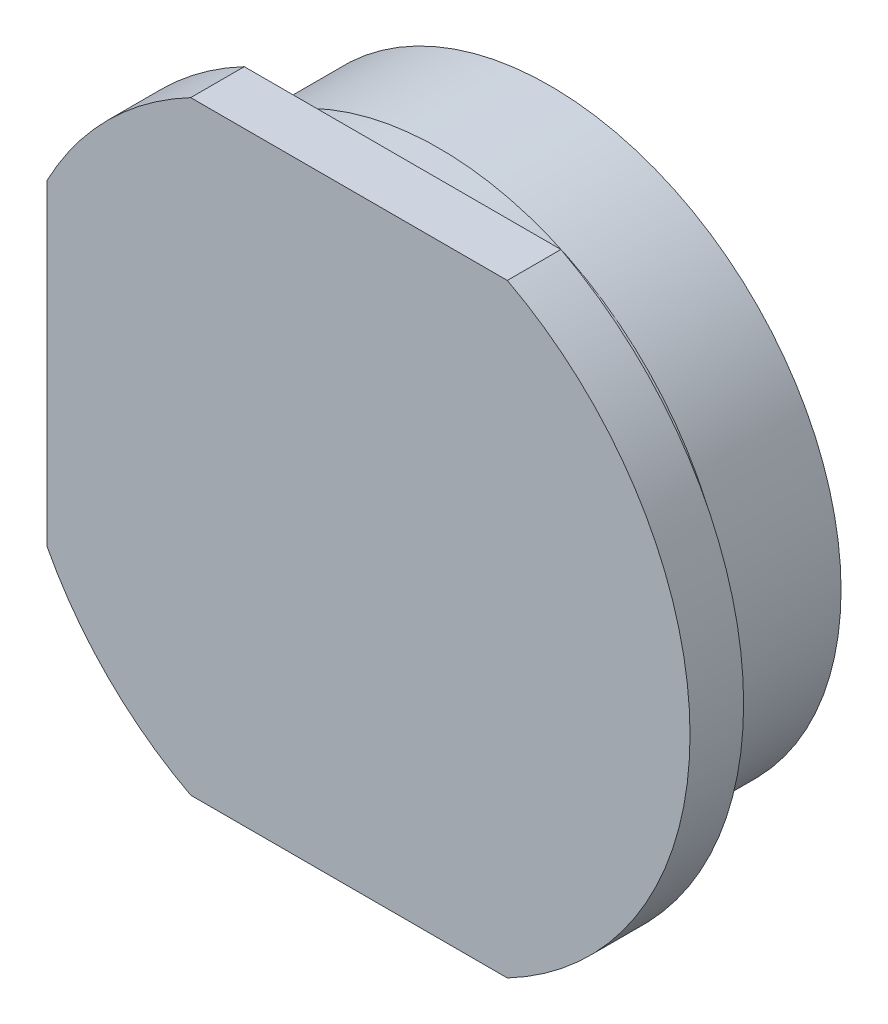
ISO-10303-21;
HEADER;
FILE_DESCRIPTION(('STEP AP214'),'2;1');
FILE_NAME('part.step','',(''),(''),'','','');
FILE_SCHEMA(('AUTOMOTIVE_DESIGN { 1 0 10303 214 1 1 1 1 }'));
ENDSEC;
DATA;
#1=APPLICATION_CONTEXT('core data for automotive mechanical design processes');
#2=APPLICATION_PROTOCOL_DEFINITION('international standard','automotive_design',2000,#1);
#3=PRODUCT_CONTEXT('',#1,'mechanical');
#4=PRODUCT('Part','Part','',(#3));
#5=PRODUCT_RELATED_PRODUCT_CATEGORY('part','',(#4));
#6=PRODUCT_DEFINITION_FORMATION('','',#4);
#7=PRODUCT_DEFINITION_CONTEXT('part definition',#1,'design');
#8=PRODUCT_DEFINITION('design','',#6,#7);
#9=PRODUCT_DEFINITION_SHAPE('','',#8);
#10=(LENGTH_UNIT() NAMED_UNIT(*) SI_UNIT(.MILLI.,.METRE.));
#11=(NAMED_UNIT(*) PLANE_ANGLE_UNIT() SI_UNIT($,.RADIAN.));
#12=(NAMED_UNIT(*) SI_UNIT($,.STERADIAN.) SOLID_ANGLE_UNIT());
#13=UNCERTAINTY_MEASURE_WITH_UNIT(LENGTH_MEASURE(1.E-05),#10,'distance_accuracy_value','');
#14=(GEOMETRIC_REPRESENTATION_CONTEXT(3) GLOBAL_UNCERTAINTY_ASSIGNED_CONTEXT((#13)) GLOBAL_UNIT_ASSIGNED_CONTEXT((#10,
#11,#12)) REPRESENTATION_CONTEXT('',''));
#15=CARTESIAN_POINT('',(0.,0.,0.));
#16=DIRECTION('',(0.,0.,1.));
#17=DIRECTION('',(1.,0.,0.));
#18=AXIS2_PLACEMENT_3D('',#15,#16,#17);
#19=CARTESIAN_POINT('',(-120.56,0.,90.5));
#20=DIRECTION('',(0.,0.,-1.));
#21=DIRECTION('',(-1.,0.,0.));
#22=AXIS2_PLACEMENT_3D('',#19,#20,#21);
#23=PLANE('',#22);
#24=DIRECTION('',(0.,-1.,0.));
#25=VECTOR('',#24,1.);
#26=CARTESIAN_POINT('',(-124.,124.,90.5));
#27=LINE('',#26,#25);
#28=CARTESIAN_POINT('',(-124.,64.9923072370877,90.5));
#29=VERTEX_POINT('',#28);
#30=CARTESIAN_POINT('',(-124.,-64.9923072370877,90.5));
#31=VERTEX_POINT('',#30);
#32=EDGE_CURVE('E75',#29,#31,#27,.T.);
#33=ORIENTED_EDGE('',*,*,#32,.T.);
#34=CARTESIAN_POINT('',(0.,0.,90.5));
#35=DIRECTION('',(0.,0.,-1.));
#36=DIRECTION('',(-1.,0.,0.));
#37=AXIS2_PLACEMENT_3D('',#34,#35,#36);
#38=CIRCLE('',#37,140.);
#39=CARTESIAN_POINT('',(-64.9923072370877,-124.,90.5));
#40=VERTEX_POINT('',#39);
#41=EDGE_CURVE('E83',#40,#31,#38,.T.);
#42=ORIENTED_EDGE('',*,*,#41,.F.);
#43=DIRECTION('',(1.,0.,0.));
#44=VECTOR('',#43,1.);
#45=CARTESIAN_POINT('',(-124.,-124.,90.5));
#46=LINE('',#45,#44);
#47=CARTESIAN_POINT('',(64.9923072370878,-124.,90.5));
#48=VERTEX_POINT('',#47);
#49=EDGE_CURVE('E66',#40,#48,#46,.T.);
#50=ORIENTED_EDGE('',*,*,#49,.T.);
#51=CARTESIAN_POINT('',(64.9923072370877,124.,90.5));
#52=VERTEX_POINT('',#51);
#53=EDGE_CURVE('E90',#52,#48,#38,.T.);
#54=ORIENTED_EDGE('',*,*,#53,.F.);
#55=DIRECTION('',(-1.,0.,0.));
#56=VECTOR('',#55,1.);
#57=CARTESIAN_POINT('',(150.,124.,90.5));
#58=LINE('',#57,#56);
#59=CARTESIAN_POINT('',(-64.9923072370877,124.,90.5));
#60=VERTEX_POINT('',#59);
#61=EDGE_CURVE('E76',#52,#60,#58,.T.);
#62=ORIENTED_EDGE('',*,*,#61,.T.);
#63=EDGE_CURVE('E93',#29,#60,#38,.T.);
#64=ORIENTED_EDGE('',*,*,#63,.F.);
#65=EDGE_LOOP('',(#33,#42,#50,#54,#62,#64));
#66=FACE_BOUND('',#65,.T.);
#67=ADVANCED_FACE('F17',(#66),#23,.F.);
#68=CARTESIAN_POINT('',(0.,0.,104.));
#69=DIRECTION('',(0.,0.,-1.));
#70=DIRECTION('',(-1.,0.,0.));
#71=AXIS2_PLACEMENT_3D('',#68,#69,#70);
#72=CYLINDRICAL_SURFACE('',#71,140.);
#73=DIRECTION('',(0.,0.,-1.));
#74=VECTOR('',#73,1.);
#75=CARTESIAN_POINT('',(-124.,64.9923072370877,104.));
#76=LINE('',#75,#74);
#77=CARTESIAN_POINT('',(-124.,64.9923072370877,68.5));
#78=VERTEX_POINT('',#77);
#79=EDGE_CURVE('E114',#29,#78,#76,.T.);
#80=ORIENTED_EDGE('',*,*,#79,.F.);
#81=ORIENTED_EDGE('',*,*,#63,.T.);
#82=DIRECTION('',(0.,0.,-1.));
#83=VECTOR('',#82,1.);
#84=CARTESIAN_POINT('',(-64.9923072370877,124.,104.));
#85=LINE('',#84,#83);
#86=CARTESIAN_POINT('',(-64.9923072370877,124.,68.5));
#87=VERTEX_POINT('',#86);
#88=EDGE_CURVE('E86',#87,#60,#85,.F.);
#89=ORIENTED_EDGE('',*,*,#88,.F.);
#90=CARTESIAN_POINT('',(0.,0.,68.5));
#91=DIRECTION('',(0.,0.,-1.));
#92=DIRECTION('',(-1.,0.,0.));
#93=AXIS2_PLACEMENT_3D('',#90,#91,#92);
#94=CIRCLE('',#93,140.);
#95=EDGE_CURVE('E91',#78,#87,#94,.T.);
#96=ORIENTED_EDGE('',*,*,#95,.F.);
#97=EDGE_LOOP('',(#80,#81,#89,#96));
#98=FACE_BOUND('',#97,.T.);
#99=ADVANCED_FACE('F146',(#98),#72,.T.);
#100=DIRECTION('',(0.,0.,-1.));
#101=VECTOR('',#100,1.);
#102=CARTESIAN_POINT('',(-124.,-64.9923072370877,104.));
#103=LINE('',#102,#101);
#104=CARTESIAN_POINT('',(-124.,-64.9923072370877,68.5));
#105=VERTEX_POINT('',#104);
#106=EDGE_CURVE('E118',#105,#31,#103,.F.);
#107=ORIENTED_EDGE('',*,*,#106,.F.);
#108=CARTESIAN_POINT('',(-64.9923072370877,-124.,68.5));
#109=VERTEX_POINT('',#108);
#110=EDGE_CURVE('E85',#109,#105,#94,.T.);
#111=ORIENTED_EDGE('',*,*,#110,.F.);
#112=DIRECTION('',(0.,0.,-1.));
#113=VECTOR('',#112,1.);
#114=CARTESIAN_POINT('',(-64.9923072370877,-124.,104.));
#115=LINE('',#114,#113);
#116=EDGE_CURVE('E31',#40,#109,#115,.T.);
#117=ORIENTED_EDGE('',*,*,#116,.F.);
#118=ORIENTED_EDGE('',*,*,#41,.T.);
#119=EDGE_LOOP('',(#107,#111,#117,#118));
#120=FACE_BOUND('',#119,.T.);
#121=ADVANCED_FACE('F82',(#120),#72,.T.);
#122=DIRECTION('',(0.,0.,-1.));
#123=VECTOR('',#122,1.);
#124=CARTESIAN_POINT('',(64.9923072370877,124.,104.));
#125=LINE('',#124,#123);
#126=CARTESIAN_POINT('',(64.9923072370877,124.,68.5));
#127=VERTEX_POINT('',#126);
#128=EDGE_CURVE('E39',#52,#127,#125,.T.);
#129=ORIENTED_EDGE('',*,*,#128,.F.);
#130=ORIENTED_EDGE('',*,*,#53,.T.);
#131=DIRECTION('',(0.,0.,-1.));
#132=VECTOR('',#131,1.);
#133=CARTESIAN_POINT('',(64.9923072370878,-124.,104.));
#134=LINE('',#133,#132);
#135=CARTESIAN_POINT('',(64.9923072370878,-124.,68.5));
#136=VERTEX_POINT('',#135);
#137=EDGE_CURVE('E69',#136,#48,#134,.F.);
#138=ORIENTED_EDGE('',*,*,#137,.F.);
#139=EDGE_CURVE('E95',#127,#136,#94,.T.);
#140=ORIENTED_EDGE('',*,*,#139,.F.);
#141=EDGE_LOOP('',(#129,#130,#138,#140));
#142=FACE_BOUND('',#141,.T.);
#143=ADVANCED_FACE('F137',(#142),#72,.T.);
#144=CARTESIAN_POINT('',(-140.,0.,68.5));
#145=DIRECTION('',(0.,0.,1.));
#146=DIRECTION('',(1.,0.,0.));
#147=AXIS2_PLACEMENT_3D('',#144,#145,#146);
#148=PLANE('',#147);
#149=CARTESIAN_POINT('',(0.,0.,68.5));
#150=DIRECTION('',(0.,0.,-1.));
#151=DIRECTION('',(-1.,0.,0.));
#152=AXIS2_PLACEMENT_3D('',#149,#150,#151);
#153=CIRCLE('',#152,120.);
#154=CARTESIAN_POINT('',(-120.,0.,68.5));
#155=VERTEX_POINT('',#154);
#156=EDGE_CURVE('E127',#155,#155,#153,.T.);
#157=ORIENTED_EDGE('',*,*,#156,.F.);
#158=EDGE_LOOP('',(#157));
#159=FACE_BOUND('',#158,.T.);
#160=DIRECTION('',(0.,-1.,0.));
#161=VECTOR('',#160,1.);
#162=CARTESIAN_POINT('',(-124.,0.,68.5));
#163=LINE('',#162,#161);
#164=EDGE_CURVE('E11',#78,#105,#163,.T.);
#165=ORIENTED_EDGE('',*,*,#164,.F.);
#166=ORIENTED_EDGE('',*,*,#95,.T.);
#167=DIRECTION('',(-1.,0.,0.));
#168=VECTOR('',#167,1.);
#169=CARTESIAN_POINT('',(-140.,124.,68.5));
#170=LINE('',#169,#168);
#171=EDGE_CURVE('E24',#127,#87,#170,.T.);
#172=ORIENTED_EDGE('',*,*,#171,.F.);
#173=ORIENTED_EDGE('',*,*,#139,.T.);
#174=DIRECTION('',(1.,0.,0.));
#175=VECTOR('',#174,1.);
#176=CARTESIAN_POINT('',(-140.,-124.,68.5));
#177=LINE('',#176,#175);
#178=EDGE_CURVE('E99',#109,#136,#177,.T.);
#179=ORIENTED_EDGE('',*,*,#178,.F.);
#180=ORIENTED_EDGE('',*,*,#110,.T.);
#181=EDGE_LOOP('',(#165,#166,#172,#173,#179,#180));
#182=FACE_BOUND('',#181,.T.);
#183=ADVANCED_FACE('F135',(#159,#182),#148,.F.);
#184=CARTESIAN_POINT('',(0.,0.,104.));
#185=DIRECTION('',(0.,0.,-1.));
#186=DIRECTION('',(-1.,0.,0.));
#187=AXIS2_PLACEMENT_3D('',#184,#185,#186);
#188=CYLINDRICAL_SURFACE('',#187,120.);
#189=CARTESIAN_POINT('',(0.,0.,53.5));
#190=DIRECTION('',(0.,0.,1.));
#191=DIRECTION('',(1.,0.,0.));
#192=AXIS2_PLACEMENT_3D('',#189,#190,#191);
#193=CIRCLE('',#192,120.);
#194=CARTESIAN_POINT('',(120.,0.,53.5));
#195=VERTEX_POINT('',#194);
#196=EDGE_CURVE('E105',#195,#195,#193,.T.);
#197=ORIENTED_EDGE('',*,*,#196,.T.);
#198=EDGE_LOOP('',(#197));
#199=FACE_BOUND('',#198,.T.);
#200=ORIENTED_EDGE('',*,*,#156,.T.);
#201=EDGE_LOOP('',(#200));
#202=FACE_BOUND('',#201,.T.);
#203=ADVANCED_FACE('F180',(#199,#202),#188,.T.);
#204=CARTESIAN_POINT('',(59.75,0.,53.5));
#205=DIRECTION('',(0.,0.,1.));
#206=DIRECTION('',(1.,0.,0.));
#207=AXIS2_PLACEMENT_3D('',#204,#205,#206);
#208=PLANE('',#207);
#209=CARTESIAN_POINT('',(0.,0.,53.5));
#210=DIRECTION('',(0.,0.,-1.));
#211=DIRECTION('',(1.,0.,0.));
#212=AXIS2_PLACEMENT_3D('',#209,#210,#211);
#213=CIRCLE('',#212,119.5);
#214=CARTESIAN_POINT('',(119.5,0.,53.5));
#215=VERTEX_POINT('',#214);
#216=EDGE_CURVE('E110',#215,#215,#213,.T.);
#217=ORIENTED_EDGE('',*,*,#216,.F.);
#218=EDGE_LOOP('',(#217));
#219=FACE_BOUND('',#218,.T.);
#220=ORIENTED_EDGE('',*,*,#196,.F.);
#221=EDGE_LOOP('',(#220));
#222=FACE_BOUND('',#221,.T.);
#223=ADVANCED_FACE('F185',(#219,#222),#208,.F.);
#224=CARTESIAN_POINT('',(0.,0.,53.5));
#225=DIRECTION('',(0.,0.,-1.));
#226=DIRECTION('',(-1.,0.,0.));
#227=AXIS2_PLACEMENT_3D('',#224,#225,#226);
#228=CYLINDRICAL_SURFACE('',#227,119.5);
#229=ORIENTED_EDGE('',*,*,#216,.T.);
#230=EDGE_LOOP('',(#229));
#231=FACE_BOUND('',#230,.T.);
#232=CARTESIAN_POINT('',(0.,0.,8.));
#233=DIRECTION('',(0.,0.,1.));
#234=DIRECTION('',(1.,0.,0.));
#235=AXIS2_PLACEMENT_3D('',#232,#233,#234);
#236=CIRCLE('',#235,119.5);
#237=CARTESIAN_POINT('',(119.5,0.,8.));
#238=VERTEX_POINT('',#237);
#239=EDGE_CURVE('E108',#238,#238,#236,.T.);
#240=ORIENTED_EDGE('',*,*,#239,.T.);
#241=EDGE_LOOP('',(#240));
#242=FACE_BOUND('',#241,.T.);
#243=ADVANCED_FACE('F199',(#231,#242),#228,.T.);
#244=CARTESIAN_POINT('',(-102.,0.,0.));
#245=DIRECTION('',(0.,0.,1.));
#246=DIRECTION('',(1.,0.,0.));
#247=AXIS2_PLACEMENT_3D('',#244,#245,#246);
#248=PLANE('',#247);
#249=CARTESIAN_POINT('',(0.,0.,0.));
#250=DIRECTION('',(0.,0.,-1.));
#251=DIRECTION('',(-1.,0.,0.));
#252=AXIS2_PLACEMENT_3D('',#249,#250,#251);
#253=CIRCLE('',#252,102.);
#254=CARTESIAN_POINT('',(-102.,0.,0.));
#255=VERTEX_POINT('',#254);
#256=EDGE_CURVE('E107',#255,#255,#253,.T.);
#257=ORIENTED_EDGE('',*,*,#256,.T.);
#258=EDGE_LOOP('',(#257));
#259=FACE_BOUND('',#258,.T.);
#260=ADVANCED_FACE('F195',(#259),#248,.F.);
#261=CARTESIAN_POINT('',(0.,0.,104.));
#262=DIRECTION('',(0.,0.,-1.));
#263=DIRECTION('',(-1.,0.,0.));
#264=AXIS2_PLACEMENT_3D('',#261,#262,#263);
#265=CYLINDRICAL_SURFACE('',#264,102.);
#266=ORIENTED_EDGE('',*,*,#256,.F.);
#267=EDGE_LOOP('',(#266));
#268=FACE_BOUND('',#267,.T.);
#269=CARTESIAN_POINT('',(0.,0.,8.));
#270=DIRECTION('',(0.,0.,-1.));
#271=DIRECTION('',(-1.,0.,0.));
#272=AXIS2_PLACEMENT_3D('',#269,#270,#271);
#273=CIRCLE('',#272,102.);
#274=CARTESIAN_POINT('',(-102.,0.,8.));
#275=VERTEX_POINT('',#274);
#276=EDGE_CURVE('E124',#275,#275,#273,.T.);
#277=ORIENTED_EDGE('',*,*,#276,.T.);
#278=EDGE_LOOP('',(#277));
#279=FACE_BOUND('',#278,.T.);
#280=ADVANCED_FACE('F191',(#268,#279),#265,.T.);
#281=CARTESIAN_POINT('',(-120.,0.,8.));
#282=DIRECTION('',(0.,0.,1.));
#283=DIRECTION('',(1.,0.,0.));
#284=AXIS2_PLACEMENT_3D('',#281,#282,#283);
#285=PLANE('',#284);
#286=ORIENTED_EDGE('',*,*,#276,.F.);
#287=EDGE_LOOP('',(#286));
#288=FACE_BOUND('',#287,.T.);
#289=ORIENTED_EDGE('',*,*,#239,.F.);
#290=EDGE_LOOP('',(#289));
#291=FACE_BOUND('',#290,.T.);
#292=ADVANCED_FACE('F165',(#288,#291),#285,.F.);
#293=CARTESIAN_POINT('',(-124.,-124.,60.5));
#294=DIRECTION('',(0.,-1.,0.));
#295=DIRECTION('',(1.,0.,0.));
#296=AXIS2_PLACEMENT_3D('',#293,#294,#295);
#297=PLANE('',#296);
#298=ORIENTED_EDGE('',*,*,#116,.T.);
#299=ORIENTED_EDGE('',*,*,#178,.T.);
#300=ORIENTED_EDGE('',*,*,#137,.T.);
#301=ORIENTED_EDGE('',*,*,#49,.F.);
#302=EDGE_LOOP('',(#298,#299,#300,#301));
#303=FACE_BOUND('',#302,.T.);
#304=ADVANCED_FACE('F67',(#303),#297,.T.);
#305=CARTESIAN_POINT('',(150.,124.,60.5));
#306=DIRECTION('',(0.,1.,0.));
#307=DIRECTION('',(0.,0.,1.));
#308=AXIS2_PLACEMENT_3D('',#305,#306,#307);
#309=PLANE('',#308);
#310=ORIENTED_EDGE('',*,*,#128,.T.);
#311=ORIENTED_EDGE('',*,*,#171,.T.);
#312=ORIENTED_EDGE('',*,*,#88,.T.);
#313=ORIENTED_EDGE('',*,*,#61,.F.);
#314=EDGE_LOOP('',(#310,#311,#312,#313));
#315=FACE_BOUND('',#314,.T.);
#316=ADVANCED_FACE('F148',(#315),#309,.T.);
#317=CARTESIAN_POINT('',(-124.,124.,60.5));
#318=DIRECTION('',(-1.,0.,0.));
#319=DIRECTION('',(0.,-1.,0.));
#320=AXIS2_PLACEMENT_3D('',#317,#318,#319);
#321=PLANE('',#320);
#322=ORIENTED_EDGE('',*,*,#79,.T.);
#323=ORIENTED_EDGE('',*,*,#164,.T.);
#324=ORIENTED_EDGE('',*,*,#106,.T.);
#325=ORIENTED_EDGE('',*,*,#32,.F.);
#326=EDGE_LOOP('',(#322,#323,#324,#325));
#327=FACE_BOUND('',#326,.T.);
#328=ADVANCED_FACE('F144',(#327),#321,.T.);
#329=CLOSED_SHELL('',(#67,#99,#121,#143,#183,#203,#223,#243,#260,#280,#292,#304,#316,#328));
#330=MANIFOLD_SOLID_BREP('B1',#329);
#331=ADVANCED_BREP_SHAPE_REPRESENTATION('',(#18,#330),#14);
#332=SHAPE_DEFINITION_REPRESENTATION(#9,#331);
ENDSEC;
END-ISO-10303-21;
